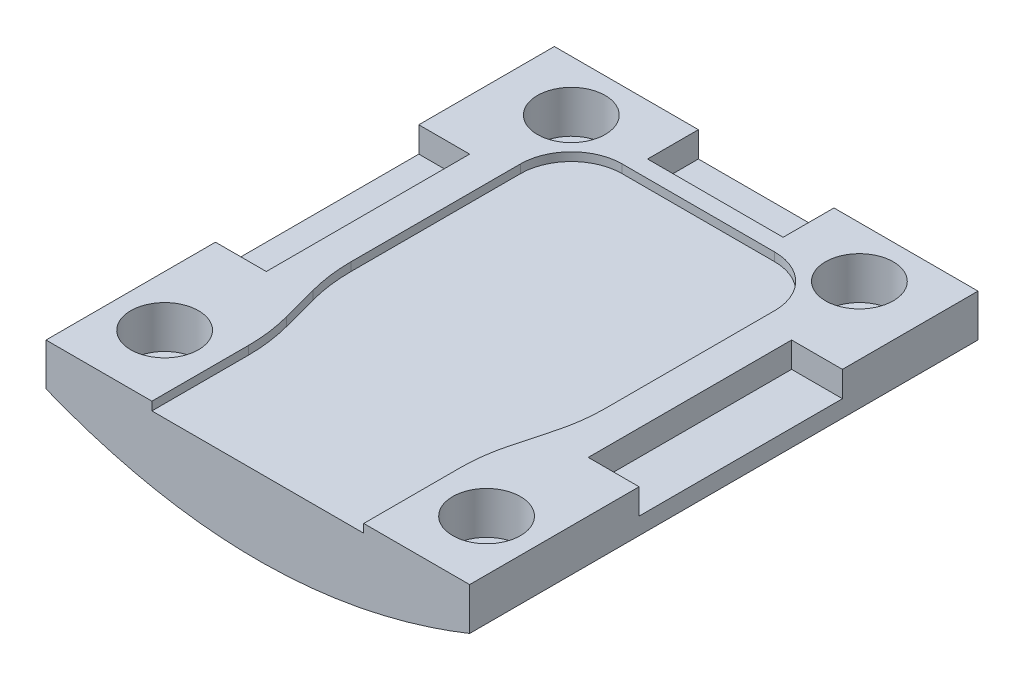
ISO-10303-21;
HEADER;
FILE_DESCRIPTION(('STEP AP214'),'2;1');
FILE_NAME('part.step','',(''),(''),'','','');
FILE_SCHEMA(('AUTOMOTIVE_DESIGN { 1 0 10303 214 1 1 1 1 }'));
ENDSEC;
DATA;
#1=APPLICATION_CONTEXT('core data for automotive mechanical design processes');
#2=APPLICATION_PROTOCOL_DEFINITION('international standard','automotive_design',2000,#1);
#3=PRODUCT_CONTEXT('',#1,'mechanical');
#4=PRODUCT('Part','Part','',(#3));
#5=PRODUCT_RELATED_PRODUCT_CATEGORY('part','',(#4));
#6=PRODUCT_DEFINITION_FORMATION('','',#4);
#7=PRODUCT_DEFINITION_CONTEXT('part definition',#1,'design');
#8=PRODUCT_DEFINITION('design','',#6,#7);
#9=PRODUCT_DEFINITION_SHAPE('','',#8);
#10=(LENGTH_UNIT() NAMED_UNIT(*) SI_UNIT(.MILLI.,.METRE.));
#11=(NAMED_UNIT(*) PLANE_ANGLE_UNIT() SI_UNIT($,.RADIAN.));
#12=(NAMED_UNIT(*) SI_UNIT($,.STERADIAN.) SOLID_ANGLE_UNIT());
#13=UNCERTAINTY_MEASURE_WITH_UNIT(LENGTH_MEASURE(1.E-05),#10,'distance_accuracy_value','');
#14=(GEOMETRIC_REPRESENTATION_CONTEXT(3) GLOBAL_UNCERTAINTY_ASSIGNED_CONTEXT((#13)) GLOBAL_UNIT_ASSIGNED_CONTEXT((#10,
#11,#12)) REPRESENTATION_CONTEXT('',''));
#15=CARTESIAN_POINT('',(0.,0.,0.));
#16=DIRECTION('',(0.,0.,1.));
#17=DIRECTION('',(1.,0.,0.));
#18=AXIS2_PLACEMENT_3D('',#15,#16,#17);
#19=CARTESIAN_POINT('',(0.,2.5,0.));
#20=DIRECTION('',(0.,0.,-1.));
#21=DIRECTION('',(-1.,0.,0.));
#22=AXIS2_PLACEMENT_3D('',#19,#20,#21);
#23=PLANE('',#22);
#24=DIRECTION('',(0.,1.,0.));
#25=VECTOR('',#24,1.);
#26=CARTESIAN_POINT('',(18.75,2.,0.));
#27=LINE('',#26,#25);
#28=CARTESIAN_POINT('',(18.75,2.,0.));
#29=VERTEX_POINT('',#28);
#30=CARTESIAN_POINT('',(18.75,2.5,0.));
#31=VERTEX_POINT('',#30);
#32=EDGE_CURVE('E463',#29,#31,#27,.T.);
#33=ORIENTED_EDGE('',*,*,#32,.F.);
#34=DIRECTION('',(1.,0.,0.));
#35=VECTOR('',#34,1.);
#36=CARTESIAN_POINT('',(6.25,2.,0.));
#37=LINE('',#36,#35);
#38=CARTESIAN_POINT('',(6.25,2.,0.));
#39=VERTEX_POINT('',#38);
#40=EDGE_CURVE('E466',#39,#29,#37,.T.);
#41=ORIENTED_EDGE('',*,*,#40,.F.);
#42=DIRECTION('',(0.,1.,0.));
#43=VECTOR('',#42,1.);
#44=CARTESIAN_POINT('',(6.25,2.,0.));
#45=LINE('',#44,#43);
#46=CARTESIAN_POINT('',(6.25,2.5,0.));
#47=VERTEX_POINT('',#46);
#48=EDGE_CURVE('E473',#39,#47,#45,.T.);
#49=ORIENTED_EDGE('',*,*,#48,.T.);
#50=DIRECTION('',(1.,0.,0.));
#51=VECTOR('',#50,1.);
#52=CARTESIAN_POINT('',(0.,2.5,0.));
#53=LINE('',#52,#51);
#54=CARTESIAN_POINT('',(0.,2.5,0.));
#55=VERTEX_POINT('',#54);
#56=EDGE_CURVE('E510',#55,#47,#53,.T.);
#57=ORIENTED_EDGE('',*,*,#56,.F.);
#58=DIRECTION('',(0.,-1.,0.));
#59=VECTOR('',#58,1.);
#60=CARTESIAN_POINT('',(0.,2.5,0.));
#61=LINE('',#60,#59);
#62=CARTESIAN_POINT('',(0.,0.,0.));
#63=VERTEX_POINT('',#62);
#64=EDGE_CURVE('E11',#55,#63,#61,.T.);
#65=ORIENTED_EDGE('',*,*,#64,.T.);
#66=CARTESIAN_POINT('',(0.,0.,0.));
#67=CARTESIAN_POINT('',(12.5,-5.,0.));
#68=CARTESIAN_POINT('',(25.,0.,0.));
#69=B_SPLINE_CURVE_WITH_KNOTS('',2,(#66,#67,#68),.UNSPECIFIED.,.F.,.F.,(3,3),(0.,1.),.UNSPECIFIED.);
#70=CARTESIAN_POINT('',(25.,0.,0.));
#71=VERTEX_POINT('',#70);
#72=EDGE_CURVE('E358',#63,#71,#69,.T.);
#73=ORIENTED_EDGE('',*,*,#72,.T.);
#74=DIRECTION('',(0.,-1.,0.));
#75=VECTOR('',#74,1.);
#76=CARTESIAN_POINT('',(25.,2.5,0.));
#77=LINE('',#76,#75);
#78=CARTESIAN_POINT('',(25.,2.5,0.));
#79=VERTEX_POINT('',#78);
#80=EDGE_CURVE('E48',#79,#71,#77,.T.);
#81=ORIENTED_EDGE('',*,*,#80,.F.);
#82=EDGE_CURVE('E468',#31,#79,#53,.T.);
#83=ORIENTED_EDGE('',*,*,#82,.F.);
#84=EDGE_LOOP('',(#33,#41,#49,#57,#65,#73,#81,#83));
#85=FACE_BOUND('',#84,.T.);
#86=ADVANCED_FACE('F39',(#85),#23,.F.);
#87=CARTESIAN_POINT('',(0.,2.5,0.));
#88=DIRECTION('',(0.,-1.,0.));
#89=DIRECTION('',(0.,0.,-1.));
#90=AXIS2_PLACEMENT_3D('',#87,#88,#89);
#91=PLANE('',#90);
#92=CARTESIAN_POINT('',(22.,2.5,-4.));
#93=DIRECTION('',(0.,1.,0.));
#94=DIRECTION('',(0.,0.,1.));
#95=AXIS2_PLACEMENT_3D('',#92,#93,#94);
#96=CIRCLE('',#95,2.);
#97=CARTESIAN_POINT('',(22.,2.5,-2.));
#98=VERTEX_POINT('',#97);
#99=EDGE_CURVE('E676',#98,#98,#96,.T.);
#100=ORIENTED_EDGE('',*,*,#99,.F.);
#101=EDGE_LOOP('',(#100));
#102=FACE_BOUND('',#101,.T.);
#103=CARTESIAN_POINT('',(3.,2.5,-4.));
#104=DIRECTION('',(0.,1.,0.));
#105=DIRECTION('',(0.,0.,1.));
#106=AXIS2_PLACEMENT_3D('',#103,#104,#105);
#107=CIRCLE('',#106,2.);
#108=CARTESIAN_POINT('',(3.,2.5,-2.));
#109=VERTEX_POINT('',#108);
#110=EDGE_CURVE('E680',#109,#109,#107,.T.);
#111=ORIENTED_EDGE('',*,*,#110,.F.);
#112=EDGE_LOOP('',(#111));
#113=FACE_BOUND('',#112,.T.);
#114=CARTESIAN_POINT('',(3.99999999999999,2.5,-27.));
#115=DIRECTION('',(0.,1.,0.));
#116=DIRECTION('',(0.,0.,1.));
#117=AXIS2_PLACEMENT_3D('',#114,#115,#116);
#118=CIRCLE('',#117,2.);
#119=CARTESIAN_POINT('',(3.99999999999999,2.5,-25.));
#120=VERTEX_POINT('',#119);
#121=EDGE_CURVE('E675',#120,#120,#118,.T.);
#122=ORIENTED_EDGE('',*,*,#121,.F.);
#123=EDGE_LOOP('',(#122));
#124=FACE_BOUND('',#123,.T.);
#125=CARTESIAN_POINT('',(21.,2.5,-27.));
#126=DIRECTION('',(0.,1.,0.));
#127=DIRECTION('',(0.,0.,1.));
#128=AXIS2_PLACEMENT_3D('',#125,#126,#127);
#129=CIRCLE('',#128,2.);
#130=CARTESIAN_POINT('',(21.,2.5,-25.));
#131=VERTEX_POINT('',#130);
#132=EDGE_CURVE('E625',#131,#131,#129,.T.);
#133=ORIENTED_EDGE('',*,*,#132,.F.);
#134=EDGE_LOOP('',(#133));
#135=FACE_BOUND('',#134,.T.);
#136=DIRECTION('',(-1.,0.,0.));
#137=VECTOR('',#136,1.);
#138=CARTESIAN_POINT('',(0.,2.5,-30.));
#139=LINE('',#138,#137);
#140=CARTESIAN_POINT('',(25.,2.5,-30.));
#141=VERTEX_POINT('',#140);
#142=CARTESIAN_POINT('',(16.5,2.5,-30.));
#143=VERTEX_POINT('',#142);
#144=EDGE_CURVE('E519',#141,#143,#139,.T.);
#145=ORIENTED_EDGE('',*,*,#144,.T.);
#146=DIRECTION('',(0.,0.,-1.));
#147=VECTOR('',#146,1.);
#148=CARTESIAN_POINT('',(16.5,2.5,-30.));
#149=LINE('',#148,#147);
#150=CARTESIAN_POINT('',(16.5,2.5,-27.));
#151=VERTEX_POINT('',#150);
#152=EDGE_CURVE('E307',#151,#143,#149,.T.);
#153=ORIENTED_EDGE('',*,*,#152,.F.);
#154=DIRECTION('',(1.,0.,0.));
#155=VECTOR('',#154,1.);
#156=CARTESIAN_POINT('',(16.5,2.5,-27.));
#157=LINE('',#156,#155);
#158=CARTESIAN_POINT('',(8.49999999999999,2.5,-27.));
#159=VERTEX_POINT('',#158);
#160=EDGE_CURVE('E1034',#159,#151,#157,.T.);
#161=ORIENTED_EDGE('',*,*,#160,.F.);
#162=DIRECTION('',(0.,0.,1.));
#163=VECTOR('',#162,1.);
#164=CARTESIAN_POINT('',(8.49999999999999,2.5,-30.));
#165=LINE('',#164,#163);
#166=CARTESIAN_POINT('',(8.49999999999999,2.5,-30.));
#167=VERTEX_POINT('',#166);
#168=EDGE_CURVE('E557',#167,#159,#165,.T.);
#169=ORIENTED_EDGE('',*,*,#168,.F.);
#170=CARTESIAN_POINT('',(0.,2.5,-30.));
#171=VERTEX_POINT('',#170);
#172=EDGE_CURVE('E267',#167,#171,#139,.T.);
#173=ORIENTED_EDGE('',*,*,#172,.T.);
#174=DIRECTION('',(0.,0.,1.));
#175=VECTOR('',#174,1.);
#176=CARTESIAN_POINT('',(0.,2.5,0.));
#177=LINE('',#176,#175);
#178=CARTESIAN_POINT('',(0.,2.5,-22.));
#179=VERTEX_POINT('',#178);
#180=EDGE_CURVE('E505',#171,#179,#177,.T.);
#181=ORIENTED_EDGE('',*,*,#180,.T.);
#182=DIRECTION('',(-1.,0.,0.));
#183=VECTOR('',#182,1.);
#184=CARTESIAN_POINT('',(0.,2.5,-22.));
#185=LINE('',#184,#183);
#186=CARTESIAN_POINT('',(2.99999999999999,2.5,-22.));
#187=VERTEX_POINT('',#186);
#188=EDGE_CURVE('E320',#187,#179,#185,.T.);
#189=ORIENTED_EDGE('',*,*,#188,.F.);
#190=DIRECTION('',(0.,0.,-1.));
#191=VECTOR('',#190,1.);
#192=CARTESIAN_POINT('',(2.99999999999999,2.5,-10.));
#193=LINE('',#192,#191);
#194=CARTESIAN_POINT('',(2.99999999999999,2.5,-10.));
#195=VERTEX_POINT('',#194);
#196=EDGE_CURVE('E334',#195,#187,#193,.T.);
#197=ORIENTED_EDGE('',*,*,#196,.F.);
#198=DIRECTION('',(1.,0.,0.));
#199=VECTOR('',#198,1.);
#200=CARTESIAN_POINT('',(0.,2.5,-10.));
#201=LINE('',#200,#199);
#202=CARTESIAN_POINT('',(0.,2.5,-10.));
#203=VERTEX_POINT('',#202);
#204=EDGE_CURVE('E330',#203,#195,#201,.T.);
#205=ORIENTED_EDGE('',*,*,#204,.F.);
#206=EDGE_CURVE('E509',#203,#55,#177,.T.);
#207=ORIENTED_EDGE('',*,*,#206,.T.);
#208=ORIENTED_EDGE('',*,*,#56,.T.);
#209=DIRECTION('',(0.,0.,1.));
#210=VECTOR('',#209,1.);
#211=CARTESIAN_POINT('',(6.25,2.5,-5.69032625050105));
#212=LINE('',#211,#210);
#213=CARTESIAN_POINT('',(6.25,2.5,-5.69032625050105));
#214=VERTEX_POINT('',#213);
#215=EDGE_CURVE('E595',#214,#47,#212,.T.);
#216=ORIENTED_EDGE('',*,*,#215,.F.);
#217=CARTESIAN_POINT('',(-3.75000000000001,2.5,-5.69032625050105));
#218=DIRECTION('',(0.,-1.,0.));
#219=DIRECTION('',(0.,0.,-1.));
#220=AXIS2_PLACEMENT_3D('',#217,#218,#219);
#221=CIRCLE('',#220,10.);
#222=CARTESIAN_POINT('',(5.91273584170009,2.5,-8.26550314802173));
#223=VERTEX_POINT('',#222);
#224=EDGE_CURVE('E598',#223,#214,#221,.T.);
#225=ORIENTED_EDGE('',*,*,#224,.F.);
#226=DIRECTION('',(0.257517689752066,0.,0.966273584170011));
#227=VECTOR('',#226,1.);
#228=CARTESIAN_POINT('',(5.3372641582999,2.5,-10.4248231024793));
#229=LINE('',#228,#227);
#230=CARTESIAN_POINT('',(5.3372641582999,2.5,-10.4248231024793));
#231=VERTEX_POINT('',#230);
#232=EDGE_CURVE('E602',#231,#223,#229,.T.);
#233=ORIENTED_EDGE('',*,*,#232,.F.);
#234=CARTESIAN_POINT('',(15.,2.5,-13.));
#235=DIRECTION('',(0.,-1.,0.));
#236=DIRECTION('',(0.,0.,-1.));
#237=AXIS2_PLACEMENT_3D('',#234,#235,#236);
#238=CIRCLE('',#237,10.);
#239=CARTESIAN_POINT('',(5.,2.5,-13.));
#240=VERTEX_POINT('',#239);
#241=EDGE_CURVE('E606',#231,#240,#238,.T.);
#242=ORIENTED_EDGE('',*,*,#241,.T.);
#243=DIRECTION('',(0.,0.,1.));
#244=VECTOR('',#243,1.);
#245=CARTESIAN_POINT('',(4.99999999999999,2.5,-23.));
#246=LINE('',#245,#244);
#247=CARTESIAN_POINT('',(4.99999999999999,2.5,-23.));
#248=VERTEX_POINT('',#247);
#249=EDGE_CURVE('E610',#248,#240,#246,.T.);
#250=ORIENTED_EDGE('',*,*,#249,.F.);
#251=CARTESIAN_POINT('',(7.99999999999999,2.5,-23.));
#252=DIRECTION('',(0.,1.,0.));
#253=DIRECTION('',(0.,0.,1.));
#254=AXIS2_PLACEMENT_3D('',#251,#252,#253);
#255=CIRCLE('',#254,3.);
#256=CARTESIAN_POINT('',(7.99999999999999,2.5,-26.));
#257=VERTEX_POINT('',#256);
#258=EDGE_CURVE('E614',#257,#248,#255,.T.);
#259=ORIENTED_EDGE('',*,*,#258,.F.);
#260=DIRECTION('',(1.,0.,0.));
#261=VECTOR('',#260,1.);
#262=CARTESIAN_POINT('',(7.99999999999999,2.5,-26.));
#263=LINE('',#262,#261);
#264=CARTESIAN_POINT('',(17.,2.5,-26.));
#265=VERTEX_POINT('',#264);
#266=EDGE_CURVE('E618',#257,#265,#263,.T.);
#267=ORIENTED_EDGE('',*,*,#266,.T.);
#268=CARTESIAN_POINT('',(17.,2.5,-23.));
#269=DIRECTION('',(0.,1.,0.));
#270=DIRECTION('',(0.,0.,1.));
#271=AXIS2_PLACEMENT_3D('',#268,#269,#270);
#272=CIRCLE('',#271,3.);
#273=CARTESIAN_POINT('',(20.,2.5,-23.));
#274=VERTEX_POINT('',#273);
#275=EDGE_CURVE('E622',#274,#265,#272,.T.);
#276=ORIENTED_EDGE('',*,*,#275,.F.);
#277=DIRECTION('',(0.,0.,1.));
#278=VECTOR('',#277,1.);
#279=CARTESIAN_POINT('',(20.,2.5,-23.));
#280=LINE('',#279,#278);
#281=CARTESIAN_POINT('',(20.,2.5,-13.));
#282=VERTEX_POINT('',#281);
#283=EDGE_CURVE('E575',#274,#282,#280,.T.);
#284=ORIENTED_EDGE('',*,*,#283,.T.);
#285=CARTESIAN_POINT('',(10.,2.5,-13.));
#286=DIRECTION('',(0.,1.,0.));
#287=DIRECTION('',(0.,0.,1.));
#288=AXIS2_PLACEMENT_3D('',#285,#286,#287);
#289=CIRCLE('',#288,10.);
#290=CARTESIAN_POINT('',(19.6627358417001,2.5,-10.4248231024793));
#291=VERTEX_POINT('',#290);
#292=EDGE_CURVE('E580',#291,#282,#289,.T.);
#293=ORIENTED_EDGE('',*,*,#292,.F.);
#294=DIRECTION('',(-0.257517689752069,0.,0.96627358417001));
#295=VECTOR('',#294,1.);
#296=CARTESIAN_POINT('',(19.6627358417001,2.5,-10.4248231024793));
#297=LINE('',#296,#295);
#298=CARTESIAN_POINT('',(19.0872641582999,2.5,-8.26550314802176));
#299=VERTEX_POINT('',#298);
#300=EDGE_CURVE('E584',#291,#299,#297,.T.);
#301=ORIENTED_EDGE('',*,*,#300,.T.);
#302=CARTESIAN_POINT('',(28.75,2.5,-5.69032625050105));
#303=DIRECTION('',(0.,1.,0.));
#304=DIRECTION('',(0.,0.,1.));
#305=AXIS2_PLACEMENT_3D('',#302,#303,#304);
#306=CIRCLE('',#305,10.);
#307=CARTESIAN_POINT('',(18.75,2.5,-5.69032625050106));
#308=VERTEX_POINT('',#307);
#309=EDGE_CURVE('E588',#299,#308,#306,.T.);
#310=ORIENTED_EDGE('',*,*,#309,.T.);
#311=DIRECTION('',(0.,0.,1.));
#312=VECTOR('',#311,1.);
#313=CARTESIAN_POINT('',(18.75,2.5,-5.69032625050105));
#314=LINE('',#313,#312);
#315=EDGE_CURVE('E592',#308,#31,#314,.T.);
#316=ORIENTED_EDGE('',*,*,#315,.T.);
#317=ORIENTED_EDGE('',*,*,#82,.T.);
#318=DIRECTION('',(0.,0.,-1.));
#319=VECTOR('',#318,1.);
#320=CARTESIAN_POINT('',(25.,2.5,0.));
#321=LINE('',#320,#319);
#322=CARTESIAN_POINT('',(25.,2.5,-10.));
#323=VERTEX_POINT('',#322);
#324=EDGE_CURVE('E515',#79,#323,#321,.T.);
#325=ORIENTED_EDGE('',*,*,#324,.T.);
#326=DIRECTION('',(1.,0.,0.));
#327=VECTOR('',#326,1.);
#328=CARTESIAN_POINT('',(25.,2.5,-10.));
#329=LINE('',#328,#327);
#330=CARTESIAN_POINT('',(22.,2.5,-10.));
#331=VERTEX_POINT('',#330);
#332=EDGE_CURVE('E282',#331,#323,#329,.T.);
#333=ORIENTED_EDGE('',*,*,#332,.F.);
#334=DIRECTION('',(0.,0.,1.));
#335=VECTOR('',#334,1.);
#336=CARTESIAN_POINT('',(22.,2.5,-10.));
#337=LINE('',#336,#335);
#338=CARTESIAN_POINT('',(22.,2.5,-22.));
#339=VERTEX_POINT('',#338);
#340=EDGE_CURVE('E296',#339,#331,#337,.T.);
#341=ORIENTED_EDGE('',*,*,#340,.F.);
#342=DIRECTION('',(-1.,0.,0.));
#343=VECTOR('',#342,1.);
#344=CARTESIAN_POINT('',(25.,2.5,-22.));
#345=LINE('',#344,#343);
#346=CARTESIAN_POINT('',(25.,2.5,-22.));
#347=VERTEX_POINT('',#346);
#348=EDGE_CURVE('E292',#347,#339,#345,.T.);
#349=ORIENTED_EDGE('',*,*,#348,.F.);
#350=EDGE_CURVE('E514',#347,#141,#321,.T.);
#351=ORIENTED_EDGE('',*,*,#350,.T.);
#352=EDGE_LOOP('',(#145,#153,#161,#169,#173,#181,#189,#197,#205,#207,#208,#216,#225,#233,#242,
#250,#259,#267,#276,#284,#293,#301,#310,#316,#317,#325,#333,#341,#349,#351));
#353=FACE_BOUND('',#352,.T.);
#354=ADVANCED_FACE('F447',(#102,#113,#124,#135,#353),#91,.F.);
#355=CARTESIAN_POINT('',(0.,2.5,0.));
#356=DIRECTION('',(1.,0.,0.));
#357=DIRECTION('',(0.,0.,-1.));
#358=AXIS2_PLACEMENT_3D('',#355,#356,#357);
#359=PLANE('',#358);
#360=DIRECTION('',(0.,0.,1.));
#361=VECTOR('',#360,1.);
#362=CARTESIAN_POINT('',(0.,1.,-10.));
#363=LINE('',#362,#361);
#364=CARTESIAN_POINT('',(0.,1.,-22.));
#365=VERTEX_POINT('',#364);
#366=CARTESIAN_POINT('',(0.,1.,-10.));
#367=VERTEX_POINT('',#366);
#368=EDGE_CURVE('E316',#365,#367,#363,.T.);
#369=ORIENTED_EDGE('',*,*,#368,.F.);
#370=DIRECTION('',(0.,1.,0.));
#371=VECTOR('',#370,1.);
#372=CARTESIAN_POINT('',(0.,1.,-22.));
#373=LINE('',#372,#371);
#374=EDGE_CURVE('E297',#365,#179,#373,.T.);
#375=ORIENTED_EDGE('',*,*,#374,.T.);
#376=ORIENTED_EDGE('',*,*,#180,.F.);
#377=DIRECTION('',(0.,-1.,0.));
#378=VECTOR('',#377,1.);
#379=CARTESIAN_POINT('',(0.,2.5,-30.));
#380=LINE('',#379,#378);
#381=CARTESIAN_POINT('',(0.,0.,-30.));
#382=VERTEX_POINT('',#381);
#383=EDGE_CURVE('E523',#171,#382,#380,.T.);
#384=ORIENTED_EDGE('',*,*,#383,.T.);
#385=DIRECTION('',(0.,0.,1.));
#386=VECTOR('',#385,1.);
#387=CARTESIAN_POINT('',(0.,0.,0.));
#388=LINE('',#387,#386);
#389=EDGE_CURVE('E524',#382,#63,#388,.T.);
#390=ORIENTED_EDGE('',*,*,#389,.T.);
#391=ORIENTED_EDGE('',*,*,#64,.F.);
#392=ORIENTED_EDGE('',*,*,#206,.F.);
#393=DIRECTION('',(0.,1.,0.));
#394=VECTOR('',#393,1.);
#395=CARTESIAN_POINT('',(0.,1.,-10.));
#396=LINE('',#395,#394);
#397=EDGE_CURVE('E329',#367,#203,#396,.T.);
#398=ORIENTED_EDGE('',*,*,#397,.F.);
#399=EDGE_LOOP('',(#369,#375,#376,#384,#390,#391,#392,#398));
#400=FACE_BOUND('',#399,.T.);
#401=ADVANCED_FACE('F41',(#400),#359,.F.);
#402=CARTESIAN_POINT('',(25.,2.5,0.));
#403=DIRECTION('',(-1.,0.,0.));
#404=DIRECTION('',(0.,0.,1.));
#405=AXIS2_PLACEMENT_3D('',#402,#403,#404);
#406=PLANE('',#405);
#407=DIRECTION('',(0.,0.,-1.));
#408=VECTOR('',#407,1.);
#409=CARTESIAN_POINT('',(25.,1.,-10.));
#410=LINE('',#409,#408);
#411=CARTESIAN_POINT('',(25.,1.,-10.));
#412=VERTEX_POINT('',#411);
#413=CARTESIAN_POINT('',(25.,1.,-22.));
#414=VERTEX_POINT('',#413);
#415=EDGE_CURVE('E278',#412,#414,#410,.T.);
#416=ORIENTED_EDGE('',*,*,#415,.F.);
#417=DIRECTION('',(0.,1.,0.));
#418=VECTOR('',#417,1.);
#419=CARTESIAN_POINT('',(25.,1.,-10.));
#420=LINE('',#419,#418);
#421=EDGE_CURVE('E303',#412,#323,#420,.T.);
#422=ORIENTED_EDGE('',*,*,#421,.T.);
#423=ORIENTED_EDGE('',*,*,#324,.F.);
#424=ORIENTED_EDGE('',*,*,#80,.T.);
#425=DIRECTION('',(0.,0.,-1.));
#426=VECTOR('',#425,1.);
#427=CARTESIAN_POINT('',(25.,0.,0.));
#428=LINE('',#427,#426);
#429=CARTESIAN_POINT('',(25.,0.,-30.));
#430=VERTEX_POINT('',#429);
#431=EDGE_CURVE('E528',#71,#430,#428,.T.);
#432=ORIENTED_EDGE('',*,*,#431,.T.);
#433=DIRECTION('',(0.,-1.,0.));
#434=VECTOR('',#433,1.);
#435=CARTESIAN_POINT('',(25.,2.5,-30.));
#436=LINE('',#435,#434);
#437=EDGE_CURVE('E536',#141,#430,#436,.T.);
#438=ORIENTED_EDGE('',*,*,#437,.F.);
#439=ORIENTED_EDGE('',*,*,#350,.F.);
#440=DIRECTION('',(0.,1.,0.));
#441=VECTOR('',#440,1.);
#442=CARTESIAN_POINT('',(25.,1.,-22.));
#443=LINE('',#442,#441);
#444=EDGE_CURVE('E291',#414,#347,#443,.T.);
#445=ORIENTED_EDGE('',*,*,#444,.F.);
#446=EDGE_LOOP('',(#416,#422,#423,#424,#432,#438,#439,#445));
#447=FACE_BOUND('',#446,.T.);
#448=ADVANCED_FACE('F453',(#447),#406,.F.);
#449=CARTESIAN_POINT('',(0.,2.5,-30.));
#450=DIRECTION('',(0.,0.,1.));
#451=DIRECTION('',(1.,0.,0.));
#452=AXIS2_PLACEMENT_3D('',#449,#450,#451);
#453=PLANE('',#452);
#454=DIRECTION('',(-1.,0.,0.));
#455=VECTOR('',#454,1.);
#456=CARTESIAN_POINT('',(16.5,1.,-30.));
#457=LINE('',#456,#455);
#458=CARTESIAN_POINT('',(16.5,1.,-30.));
#459=VERTEX_POINT('',#458);
#460=CARTESIAN_POINT('',(8.49999999999999,1.,-30.));
#461=VERTEX_POINT('',#460);
#462=EDGE_CURVE('E253',#459,#461,#457,.T.);
#463=ORIENTED_EDGE('',*,*,#462,.F.);
#464=DIRECTION('',(0.,1.,0.));
#465=VECTOR('',#464,1.);
#466=CARTESIAN_POINT('',(16.5,1.,-30.));
#467=LINE('',#466,#465);
#468=EDGE_CURVE('E269',#459,#143,#467,.T.);
#469=ORIENTED_EDGE('',*,*,#468,.T.);
#470=ORIENTED_EDGE('',*,*,#144,.F.);
#471=ORIENTED_EDGE('',*,*,#437,.T.);
#472=CARTESIAN_POINT('',(0.,0.,-30.));
#473=CARTESIAN_POINT('',(12.5,-5.,-30.));
#474=CARTESIAN_POINT('',(25.,0.,-30.));
#475=B_SPLINE_CURVE_WITH_KNOTS('',2,(#472,#473,#474),.UNSPECIFIED.,.F.,.F.,(3,3),(0.,1.),.UNSPECIFIED.);
#476=EDGE_CURVE('E351',#382,#430,#475,.T.);
#477=ORIENTED_EDGE('',*,*,#476,.F.);
#478=ORIENTED_EDGE('',*,*,#383,.F.);
#479=ORIENTED_EDGE('',*,*,#172,.F.);
#480=DIRECTION('',(0.,1.,0.));
#481=VECTOR('',#480,1.);
#482=CARTESIAN_POINT('',(8.49999999999999,1.,-30.));
#483=LINE('',#482,#481);
#484=EDGE_CURVE('E245',#461,#167,#483,.T.);
#485=ORIENTED_EDGE('',*,*,#484,.F.);
#486=EDGE_LOOP('',(#463,#469,#470,#471,#477,#478,#479,#485));
#487=FACE_BOUND('',#486,.T.);
#488=ADVANCED_FACE('F265',(#487),#453,.F.);
#489=CARTESIAN_POINT('',(17.,2.,-23.));
#490=DIRECTION('',(0.,1.,0.));
#491=DIRECTION('',(0.,0.,1.));
#492=AXIS2_PLACEMENT_3D('',#489,#490,#491);
#493=CYLINDRICAL_SURFACE('',#492,3.);
#494=ORIENTED_EDGE('',*,*,#275,.T.);
#495=DIRECTION('',(0.,1.,0.));
#496=VECTOR('',#495,1.);
#497=CARTESIAN_POINT('',(17.,2.,-26.));
#498=LINE('',#497,#496);
#499=CARTESIAN_POINT('',(17.,2.,-26.));
#500=VERTEX_POINT('',#499);
#501=EDGE_CURVE('E500',#500,#265,#498,.T.);
#502=ORIENTED_EDGE('',*,*,#501,.F.);
#503=CARTESIAN_POINT('',(17.,2.,-23.));
#504=DIRECTION('',(0.,1.,0.));
#505=DIRECTION('',(0.,0.,1.));
#506=AXIS2_PLACEMENT_3D('',#503,#504,#505);
#507=CIRCLE('',#506,3.);
#508=CARTESIAN_POINT('',(20.,2.,-23.));
#509=VERTEX_POINT('',#508);
#510=EDGE_CURVE('E579',#509,#500,#507,.T.);
#511=ORIENTED_EDGE('',*,*,#510,.F.);
#512=DIRECTION('',(0.,1.,0.));
#513=VECTOR('',#512,1.);
#514=CARTESIAN_POINT('',(20.,2.,-23.));
#515=LINE('',#514,#513);
#516=EDGE_CURVE('E529',#509,#274,#515,.T.);
#517=ORIENTED_EDGE('',*,*,#516,.T.);
#518=EDGE_LOOP('',(#494,#502,#511,#517));
#519=FACE_BOUND('',#518,.T.);
#520=ADVANCED_FACE('F400',(#519),#493,.F.);
#521=CARTESIAN_POINT('',(20.,2.,-23.));
#522=DIRECTION('',(-1.,0.,0.));
#523=DIRECTION('',(0.,0.,1.));
#524=AXIS2_PLACEMENT_3D('',#521,#522,#523);
#525=PLANE('',#524);
#526=ORIENTED_EDGE('',*,*,#283,.F.);
#527=ORIENTED_EDGE('',*,*,#516,.F.);
#528=DIRECTION('',(0.,0.,1.));
#529=VECTOR('',#528,1.);
#530=CARTESIAN_POINT('',(20.,2.,-23.));
#531=LINE('',#530,#529);
#532=CARTESIAN_POINT('',(20.,2.,-13.));
#533=VERTEX_POINT('',#532);
#534=EDGE_CURVE('E504',#509,#533,#531,.T.);
#535=ORIENTED_EDGE('',*,*,#534,.T.);
#536=DIRECTION('',(0.,1.,0.));
#537=VECTOR('',#536,1.);
#538=CARTESIAN_POINT('',(20.,2.,-13.));
#539=LINE('',#538,#537);
#540=EDGE_CURVE('E564',#533,#282,#539,.T.);
#541=ORIENTED_EDGE('',*,*,#540,.T.);
#542=EDGE_LOOP('',(#526,#527,#535,#541));
#543=FACE_BOUND('',#542,.T.);
#544=ADVANCED_FACE('F396',(#543),#525,.T.);
#545=CARTESIAN_POINT('',(10.,2.,-13.));
#546=DIRECTION('',(0.,1.,0.));
#547=DIRECTION('',(0.,0.,1.));
#548=AXIS2_PLACEMENT_3D('',#545,#546,#547);
#549=CYLINDRICAL_SURFACE('',#548,10.);
#550=ORIENTED_EDGE('',*,*,#292,.T.);
#551=ORIENTED_EDGE('',*,*,#540,.F.);
#552=CARTESIAN_POINT('',(10.,2.,-13.));
#553=DIRECTION('',(0.,1.,0.));
#554=DIRECTION('',(0.,0.,1.));
#555=AXIS2_PLACEMENT_3D('',#552,#553,#554);
#556=CIRCLE('',#555,10.);
#557=CARTESIAN_POINT('',(19.6627358417001,2.,-10.4248231024793));
#558=VERTEX_POINT('',#557);
#559=EDGE_CURVE('E628',#558,#533,#556,.T.);
#560=ORIENTED_EDGE('',*,*,#559,.F.);
#561=DIRECTION('',(0.,1.,0.));
#562=VECTOR('',#561,1.);
#563=CARTESIAN_POINT('',(19.6627358417001,2.,-10.4248231024793));
#564=LINE('',#563,#562);
#565=EDGE_CURVE('E567',#558,#291,#564,.T.);
#566=ORIENTED_EDGE('',*,*,#565,.T.);
#567=EDGE_LOOP('',(#550,#551,#560,#566));
#568=FACE_BOUND('',#567,.T.);
#569=ADVANCED_FACE('F399',(#568),#549,.F.);
#570=CARTESIAN_POINT('',(19.6627358417001,2.,-10.4248231024793));
#571=DIRECTION('',(-0.96627358417001,0.,-0.257517689752069));
#572=DIRECTION('',(-0.257517689752069,0.,0.96627358417001));
#573=AXIS2_PLACEMENT_3D('',#570,#571,#572);
#574=PLANE('',#573);
#575=ORIENTED_EDGE('',*,*,#300,.F.);
#576=ORIENTED_EDGE('',*,*,#565,.F.);
#577=DIRECTION('',(-0.257517689752069,0.,0.96627358417001));
#578=VECTOR('',#577,1.);
#579=CARTESIAN_POINT('',(19.6627358417001,2.,-10.4248231024793));
#580=LINE('',#579,#578);
#581=CARTESIAN_POINT('',(19.0872641582999,2.,-8.26550314802176));
#582=VERTEX_POINT('',#581);
#583=EDGE_CURVE('E632',#558,#582,#580,.T.);
#584=ORIENTED_EDGE('',*,*,#583,.T.);
#585=DIRECTION('',(0.,1.,0.));
#586=VECTOR('',#585,1.);
#587=CARTESIAN_POINT('',(19.0872641582999,2.,-8.26550314802176));
#588=LINE('',#587,#586);
#589=EDGE_CURVE('E477',#582,#299,#588,.T.);
#590=ORIENTED_EDGE('',*,*,#589,.T.);
#591=EDGE_LOOP('',(#575,#576,#584,#590));
#592=FACE_BOUND('',#591,.T.);
#593=ADVANCED_FACE('F404',(#592),#574,.T.);
#594=CARTESIAN_POINT('',(28.75,2.,-5.69032625050105));
#595=DIRECTION('',(0.,1.,0.));
#596=DIRECTION('',(0.,0.,1.));
#597=AXIS2_PLACEMENT_3D('',#594,#595,#596);
#598=CYLINDRICAL_SURFACE('',#597,10.);
#599=ORIENTED_EDGE('',*,*,#309,.F.);
#600=ORIENTED_EDGE('',*,*,#589,.F.);
#601=CARTESIAN_POINT('',(28.75,2.,-5.69032625050105));
#602=DIRECTION('',(0.,1.,0.));
#603=DIRECTION('',(0.,0.,1.));
#604=AXIS2_PLACEMENT_3D('',#601,#602,#603);
#605=CIRCLE('',#604,10.);
#606=CARTESIAN_POINT('',(18.75,2.,-5.69032625050106));
#607=VERTEX_POINT('',#606);
#608=EDGE_CURVE('E635',#582,#607,#605,.T.);
#609=ORIENTED_EDGE('',*,*,#608,.T.);
#610=DIRECTION('',(0.,1.,0.));
#611=VECTOR('',#610,1.);
#612=CARTESIAN_POINT('',(18.75,2.,-5.69032625050106));
#613=LINE('',#612,#611);
#614=EDGE_CURVE('E472',#607,#308,#613,.T.);
#615=ORIENTED_EDGE('',*,*,#614,.T.);
#616=EDGE_LOOP('',(#599,#600,#609,#615));
#617=FACE_BOUND('',#616,.T.);
#618=ADVANCED_FACE('F408',(#617),#598,.T.);
#619=CARTESIAN_POINT('',(18.75,2.,-5.69032625050105));
#620=DIRECTION('',(-1.,0.,0.));
#621=DIRECTION('',(0.,0.,1.));
#622=AXIS2_PLACEMENT_3D('',#619,#620,#621);
#623=PLANE('',#622);
#624=ORIENTED_EDGE('',*,*,#315,.F.);
#625=ORIENTED_EDGE('',*,*,#614,.F.);
#626=DIRECTION('',(0.,0.,1.));
#627=VECTOR('',#626,1.);
#628=CARTESIAN_POINT('',(18.75,2.,-5.69032625050105));
#629=LINE('',#628,#627);
#630=EDGE_CURVE('E638',#607,#29,#629,.T.);
#631=ORIENTED_EDGE('',*,*,#630,.T.);
#632=ORIENTED_EDGE('',*,*,#32,.T.);
#633=EDGE_LOOP('',(#624,#625,#631,#632));
#634=FACE_BOUND('',#633,.T.);
#635=ADVANCED_FACE('F412',(#634),#623,.T.);
#636=CARTESIAN_POINT('',(6.25,2.,-5.69032625050105));
#637=DIRECTION('',(-1.,0.,0.));
#638=DIRECTION('',(0.,0.,1.));
#639=AXIS2_PLACEMENT_3D('',#636,#637,#638);
#640=PLANE('',#639);
#641=ORIENTED_EDGE('',*,*,#215,.T.);
#642=ORIENTED_EDGE('',*,*,#48,.F.);
#643=DIRECTION('',(0.,0.,1.));
#644=VECTOR('',#643,1.);
#645=CARTESIAN_POINT('',(6.25,2.,-5.69032625050105));
#646=LINE('',#645,#644);
#647=CARTESIAN_POINT('',(6.25,2.,-5.69032625050105));
#648=VERTEX_POINT('',#647);
#649=EDGE_CURVE('E643',#648,#39,#646,.T.);
#650=ORIENTED_EDGE('',*,*,#649,.F.);
#651=DIRECTION('',(0.,1.,0.));
#652=VECTOR('',#651,1.);
#653=CARTESIAN_POINT('',(6.25,2.,-5.69032625050105));
#654=LINE('',#653,#652);
#655=EDGE_CURVE('E479',#648,#214,#654,.T.);
#656=ORIENTED_EDGE('',*,*,#655,.T.);
#657=EDGE_LOOP('',(#641,#642,#650,#656));
#658=FACE_BOUND('',#657,.T.);
#659=ADVANCED_FACE('F416',(#658),#640,.F.);
#660=CARTESIAN_POINT('',(-3.75000000000001,2.,-5.69032625050105));
#661=DIRECTION('',(0.,1.,0.));
#662=DIRECTION('',(0.,0.,1.));
#663=AXIS2_PLACEMENT_3D('',#660,#661,#662);
#664=CYLINDRICAL_SURFACE('',#663,10.);
#665=ORIENTED_EDGE('',*,*,#224,.T.);
#666=ORIENTED_EDGE('',*,*,#655,.F.);
#667=CARTESIAN_POINT('',(-3.75000000000001,2.,-5.69032625050105));
#668=DIRECTION('',(0.,-1.,0.));
#669=DIRECTION('',(0.,0.,-1.));
#670=AXIS2_PLACEMENT_3D('',#667,#668,#669);
#671=CIRCLE('',#670,10.);
#672=CARTESIAN_POINT('',(5.91273584170009,2.,-8.26550314802173));
#673=VERTEX_POINT('',#672);
#674=EDGE_CURVE('E647',#673,#648,#671,.T.);
#675=ORIENTED_EDGE('',*,*,#674,.F.);
#676=DIRECTION('',(0.,1.,0.));
#677=VECTOR('',#676,1.);
#678=CARTESIAN_POINT('',(5.91273584170009,2.,-8.26550314802173));
#679=LINE('',#678,#677);
#680=EDGE_CURVE('E485',#673,#223,#679,.T.);
#681=ORIENTED_EDGE('',*,*,#680,.T.);
#682=EDGE_LOOP('',(#665,#666,#675,#681));
#683=FACE_BOUND('',#682,.T.);
#684=ADVANCED_FACE('F420',(#683),#664,.T.);
#685=CARTESIAN_POINT('',(5.3372641582999,2.,-10.4248231024793));
#686=DIRECTION('',(-0.966273584170011,0.,0.257517689752066));
#687=DIRECTION('',(0.257517689752066,0.,0.966273584170011));
#688=AXIS2_PLACEMENT_3D('',#685,#686,#687);
#689=PLANE('',#688);
#690=ORIENTED_EDGE('',*,*,#232,.T.);
#691=ORIENTED_EDGE('',*,*,#680,.F.);
#692=DIRECTION('',(0.257517689752066,0.,0.966273584170011));
#693=VECTOR('',#692,1.);
#694=CARTESIAN_POINT('',(5.3372641582999,2.,-10.4248231024793));
#695=LINE('',#694,#693);
#696=CARTESIAN_POINT('',(5.3372641582999,2.,-10.4248231024793));
#697=VERTEX_POINT('',#696);
#698=EDGE_CURVE('E651',#697,#673,#695,.T.);
#699=ORIENTED_EDGE('',*,*,#698,.F.);
#700=DIRECTION('',(0.,1.,0.));
#701=VECTOR('',#700,1.);
#702=CARTESIAN_POINT('',(5.3372641582999,2.,-10.4248231024793));
#703=LINE('',#702,#701);
#704=EDGE_CURVE('E488',#697,#231,#703,.T.);
#705=ORIENTED_EDGE('',*,*,#704,.T.);
#706=EDGE_LOOP('',(#690,#691,#699,#705));
#707=FACE_BOUND('',#706,.T.);
#708=ADVANCED_FACE('F424',(#707),#689,.F.);
#709=CARTESIAN_POINT('',(15.,2.,-13.));
#710=DIRECTION('',(0.,1.,0.));
#711=DIRECTION('',(0.,0.,1.));
#712=AXIS2_PLACEMENT_3D('',#709,#710,#711);
#713=CYLINDRICAL_SURFACE('',#712,10.);
#714=ORIENTED_EDGE('',*,*,#241,.F.);
#715=ORIENTED_EDGE('',*,*,#704,.F.);
#716=CARTESIAN_POINT('',(15.,2.,-13.));
#717=DIRECTION('',(0.,-1.,0.));
#718=DIRECTION('',(0.,0.,-1.));
#719=AXIS2_PLACEMENT_3D('',#716,#717,#718);
#720=CIRCLE('',#719,10.);
#721=CARTESIAN_POINT('',(5.,2.,-13.));
#722=VERTEX_POINT('',#721);
#723=EDGE_CURVE('E655',#697,#722,#720,.T.);
#724=ORIENTED_EDGE('',*,*,#723,.T.);
#725=DIRECTION('',(0.,1.,0.));
#726=VECTOR('',#725,1.);
#727=CARTESIAN_POINT('',(5.,2.,-13.));
#728=LINE('',#727,#726);
#729=EDGE_CURVE('E491',#722,#240,#728,.T.);
#730=ORIENTED_EDGE('',*,*,#729,.T.);
#731=EDGE_LOOP('',(#714,#715,#724,#730));
#732=FACE_BOUND('',#731,.T.);
#733=ADVANCED_FACE('F428',(#732),#713,.F.);
#734=CARTESIAN_POINT('',(4.99999999999999,2.,-23.));
#735=DIRECTION('',(-1.,0.,0.));
#736=DIRECTION('',(0.,0.,1.));
#737=AXIS2_PLACEMENT_3D('',#734,#735,#736);
#738=PLANE('',#737);
#739=ORIENTED_EDGE('',*,*,#249,.T.);
#740=ORIENTED_EDGE('',*,*,#729,.F.);
#741=DIRECTION('',(0.,0.,1.));
#742=VECTOR('',#741,1.);
#743=CARTESIAN_POINT('',(4.99999999999999,2.,-23.));
#744=LINE('',#743,#742);
#745=CARTESIAN_POINT('',(4.99999999999999,2.,-23.));
#746=VERTEX_POINT('',#745);
#747=EDGE_CURVE('E658',#746,#722,#744,.T.);
#748=ORIENTED_EDGE('',*,*,#747,.F.);
#749=DIRECTION('',(0.,1.,0.));
#750=VECTOR('',#749,1.);
#751=CARTESIAN_POINT('',(4.99999999999999,2.,-23.));
#752=LINE('',#751,#750);
#753=EDGE_CURVE('E494',#746,#248,#752,.T.);
#754=ORIENTED_EDGE('',*,*,#753,.T.);
#755=EDGE_LOOP('',(#739,#740,#748,#754));
#756=FACE_BOUND('',#755,.T.);
#757=ADVANCED_FACE('F432',(#756),#738,.F.);
#758=CARTESIAN_POINT('',(7.99999999999999,2.,-23.));
#759=DIRECTION('',(0.,1.,0.));
#760=DIRECTION('',(0.,0.,1.));
#761=AXIS2_PLACEMENT_3D('',#758,#759,#760);
#762=CYLINDRICAL_SURFACE('',#761,3.);
#763=ORIENTED_EDGE('',*,*,#258,.T.);
#764=ORIENTED_EDGE('',*,*,#753,.F.);
#765=CARTESIAN_POINT('',(7.99999999999999,2.,-23.));
#766=DIRECTION('',(0.,1.,0.));
#767=DIRECTION('',(0.,0.,1.));
#768=AXIS2_PLACEMENT_3D('',#765,#766,#767);
#769=CIRCLE('',#768,3.);
#770=CARTESIAN_POINT('',(7.99999999999999,2.,-26.));
#771=VERTEX_POINT('',#770);
#772=EDGE_CURVE('E662',#771,#746,#769,.T.);
#773=ORIENTED_EDGE('',*,*,#772,.F.);
#774=DIRECTION('',(0.,1.,0.));
#775=VECTOR('',#774,1.);
#776=CARTESIAN_POINT('',(7.99999999999999,2.,-26.));
#777=LINE('',#776,#775);
#778=EDGE_CURVE('E497',#771,#257,#777,.T.);
#779=ORIENTED_EDGE('',*,*,#778,.T.);
#780=EDGE_LOOP('',(#763,#764,#773,#779));
#781=FACE_BOUND('',#780,.T.);
#782=ADVANCED_FACE('F436',(#781),#762,.F.);
#783=CARTESIAN_POINT('',(7.99999999999999,2.,-26.));
#784=DIRECTION('',(0.,0.,1.));
#785=DIRECTION('',(1.,0.,0.));
#786=AXIS2_PLACEMENT_3D('',#783,#784,#785);
#787=PLANE('',#786);
#788=ORIENTED_EDGE('',*,*,#266,.F.);
#789=ORIENTED_EDGE('',*,*,#778,.F.);
#790=DIRECTION('',(1.,0.,0.));
#791=VECTOR('',#790,1.);
#792=CARTESIAN_POINT('',(7.99999999999999,2.,-26.));
#793=LINE('',#792,#791);
#794=EDGE_CURVE('E666',#771,#500,#793,.T.);
#795=ORIENTED_EDGE('',*,*,#794,.T.);
#796=ORIENTED_EDGE('',*,*,#501,.T.);
#797=EDGE_LOOP('',(#788,#789,#795,#796));
#798=FACE_BOUND('',#797,.T.);
#799=ADVANCED_FACE('F394',(#798),#787,.T.);
#800=CARTESIAN_POINT('',(17.,2.,-23.));
#801=DIRECTION('',(0.,1.,0.));
#802=DIRECTION('',(0.,0.,1.));
#803=AXIS2_PLACEMENT_3D('',#800,#801,#802);
#804=PLANE('',#803);
#805=ORIENTED_EDGE('',*,*,#510,.T.);
#806=ORIENTED_EDGE('',*,*,#794,.F.);
#807=ORIENTED_EDGE('',*,*,#772,.T.);
#808=ORIENTED_EDGE('',*,*,#747,.T.);
#809=ORIENTED_EDGE('',*,*,#723,.F.);
#810=ORIENTED_EDGE('',*,*,#698,.T.);
#811=ORIENTED_EDGE('',*,*,#674,.T.);
#812=ORIENTED_EDGE('',*,*,#649,.T.);
#813=ORIENTED_EDGE('',*,*,#40,.T.);
#814=ORIENTED_EDGE('',*,*,#630,.F.);
#815=ORIENTED_EDGE('',*,*,#608,.F.);
#816=ORIENTED_EDGE('',*,*,#583,.F.);
#817=ORIENTED_EDGE('',*,*,#559,.T.);
#818=ORIENTED_EDGE('',*,*,#534,.F.);
#819=EDGE_LOOP('',(#805,#806,#807,#808,#809,#810,#811,#812,#813,#814,#815,#816,#817,#818));
#820=FACE_BOUND('',#819,.T.);
#821=ADVANCED_FACE('F390',(#820),#804,.T.);
#822=CARTESIAN_POINT('',(21.,-1.,-27.));
#823=DIRECTION('',(0.,1.,0.));
#824=DIRECTION('',(0.,0.,1.));
#825=AXIS2_PLACEMENT_3D('',#822,#823,#824);
#826=CYLINDRICAL_SURFACE('',#825,2.);
#827=CARTESIAN_POINT('',(21.,0.,-27.));
#828=DIRECTION('',(0.,1.,0.));
#829=DIRECTION('',(0.,0.,1.));
#830=AXIS2_PLACEMENT_3D('',#827,#828,#829);
#831=CIRCLE('',#830,2.);
#832=CARTESIAN_POINT('',(21.,0.,-25.));
#833=VERTEX_POINT('',#832);
#834=EDGE_CURVE('E681',#833,#833,#831,.F.);
#835=ORIENTED_EDGE('',*,*,#834,.T.);
#836=EDGE_LOOP('',(#835));
#837=FACE_BOUND('',#836,.T.);
#838=ORIENTED_EDGE('',*,*,#132,.T.);
#839=EDGE_LOOP('',(#838));
#840=FACE_BOUND('',#839,.T.);
#841=ADVANCED_FACE('F378',(#837,#840),#826,.F.);
#842=CARTESIAN_POINT('',(3.99999999999999,-1.,-27.));
#843=DIRECTION('',(0.,1.,0.));
#844=DIRECTION('',(0.,0.,1.));
#845=AXIS2_PLACEMENT_3D('',#842,#843,#844);
#846=CYLINDRICAL_SURFACE('',#845,2.);
#847=CARTESIAN_POINT('',(3.99999999999999,0.,-27.));
#848=DIRECTION('',(0.,1.,0.));
#849=DIRECTION('',(0.,0.,1.));
#850=AXIS2_PLACEMENT_3D('',#847,#848,#849);
#851=CIRCLE('',#850,2.);
#852=CARTESIAN_POINT('',(3.99999999999999,0.,-25.));
#853=VERTEX_POINT('',#852);
#854=EDGE_CURVE('E691',#853,#853,#851,.F.);
#855=ORIENTED_EDGE('',*,*,#854,.T.);
#856=EDGE_LOOP('',(#855));
#857=FACE_BOUND('',#856,.T.);
#858=ORIENTED_EDGE('',*,*,#121,.T.);
#859=EDGE_LOOP('',(#858));
#860=FACE_BOUND('',#859,.T.);
#861=ADVANCED_FACE('F374',(#857,#860),#846,.F.);
#862=CARTESIAN_POINT('',(3.,-1.,-4.));
#863=DIRECTION('',(0.,1.,0.));
#864=DIRECTION('',(0.,0.,1.));
#865=AXIS2_PLACEMENT_3D('',#862,#863,#864);
#866=CYLINDRICAL_SURFACE('',#865,2.);
#867=CARTESIAN_POINT('',(3.,0.,-4.));
#868=DIRECTION('',(0.,1.,0.));
#869=DIRECTION('',(0.,0.,1.));
#870=AXIS2_PLACEMENT_3D('',#867,#868,#869);
#871=CIRCLE('',#870,2.);
#872=CARTESIAN_POINT('',(3.,0.,-2.));
#873=VERTEX_POINT('',#872);
#874=EDGE_CURVE('E695',#873,#873,#871,.F.);
#875=ORIENTED_EDGE('',*,*,#874,.T.);
#876=EDGE_LOOP('',(#875));
#877=FACE_BOUND('',#876,.T.);
#878=ORIENTED_EDGE('',*,*,#110,.T.);
#879=EDGE_LOOP('',(#878));
#880=FACE_BOUND('',#879,.T.);
#881=ADVANCED_FACE('F377',(#877,#880),#866,.F.);
#882=CARTESIAN_POINT('',(22.,-1.,-4.));
#883=DIRECTION('',(0.,1.,0.));
#884=DIRECTION('',(0.,0.,1.));
#885=AXIS2_PLACEMENT_3D('',#882,#883,#884);
#886=CYLINDRICAL_SURFACE('',#885,2.);
#887=CARTESIAN_POINT('',(22.,0.,-4.));
#888=DIRECTION('',(0.,1.,0.));
#889=DIRECTION('',(0.,0.,1.));
#890=AXIS2_PLACEMENT_3D('',#887,#888,#889);
#891=CIRCLE('',#890,2.);
#892=CARTESIAN_POINT('',(22.,0.,-2.));
#893=VERTEX_POINT('',#892);
#894=EDGE_CURVE('E357',#893,#893,#891,.F.);
#895=ORIENTED_EDGE('',*,*,#894,.T.);
#896=EDGE_LOOP('',(#895));
#897=FACE_BOUND('',#896,.T.);
#898=ORIENTED_EDGE('',*,*,#99,.T.);
#899=EDGE_LOOP('',(#898));
#900=FACE_BOUND('',#899,.T.);
#901=ADVANCED_FACE('F382',(#897,#900),#886,.F.);
#902=CARTESIAN_POINT('',(25.,0.,-30.));
#903=DIRECTION('',(0.,1.,0.));
#904=DIRECTION('',(0.,0.,1.));
#905=AXIS2_PLACEMENT_3D('',#902,#903,#904);
#906=PLANE('',#905);
#907=ORIENTED_EDGE('',*,*,#894,.F.);
#908=EDGE_LOOP('',(#907));
#909=FACE_BOUND('',#908,.T.);
#910=ADVANCED_FACE('F386',(#909),#906,.T.);
#911=ORIENTED_EDGE('',*,*,#874,.F.);
#912=EDGE_LOOP('',(#911));
#913=FACE_BOUND('',#912,.T.);
#914=ADVANCED_FACE('F704',(#913),#906,.T.);
#915=ORIENTED_EDGE('',*,*,#854,.F.);
#916=EDGE_LOOP('',(#915));
#917=FACE_BOUND('',#916,.T.);
#918=ADVANCED_FACE('F708',(#917),#906,.T.);
#919=ORIENTED_EDGE('',*,*,#834,.F.);
#920=EDGE_LOOP('',(#919));
#921=FACE_BOUND('',#920,.T.);
#922=ADVANCED_FACE('F371',(#921),#906,.T.);
#923=DIRECTION('',(0.,0.,1.));
#924=VECTOR('',#923,1.);
#925=SURFACE_OF_LINEAR_EXTRUSION('',#475,#924);
#926=ORIENTED_EDGE('',*,*,#72,.F.);
#927=ORIENTED_EDGE('',*,*,#389,.F.);
#928=ORIENTED_EDGE('',*,*,#476,.T.);
#929=ORIENTED_EDGE('',*,*,#431,.F.);
#930=EDGE_LOOP('',(#926,#927,#928,#929));
#931=FACE_BOUND('',#930,.T.);
#932=ADVANCED_FACE('F366',(#931),#925,.T.);
#933=CARTESIAN_POINT('',(16.5,1.,-30.));
#934=DIRECTION('',(1.,0.,0.));
#935=DIRECTION('',(0.,0.,-1.));
#936=AXIS2_PLACEMENT_3D('',#933,#934,#935);
#937=PLANE('',#936);
#938=ORIENTED_EDGE('',*,*,#152,.T.);
#939=ORIENTED_EDGE('',*,*,#468,.F.);
#940=DIRECTION('',(0.,0.,-1.));
#941=VECTOR('',#940,1.);
#942=CARTESIAN_POINT('',(16.5,1.,-30.));
#943=LINE('',#942,#941);
#944=CARTESIAN_POINT('',(16.5,1.,-27.));
#945=VERTEX_POINT('',#944);
#946=EDGE_CURVE('E258',#945,#459,#943,.T.);
#947=ORIENTED_EDGE('',*,*,#946,.F.);
#948=DIRECTION('',(0.,1.,0.));
#949=VECTOR('',#948,1.);
#950=CARTESIAN_POINT('',(16.5,1.,-27.));
#951=LINE('',#950,#949);
#952=EDGE_CURVE('E273',#945,#151,#951,.T.);
#953=ORIENTED_EDGE('',*,*,#952,.T.);
#954=EDGE_LOOP('',(#938,#939,#947,#953));
#955=FACE_BOUND('',#954,.T.);
#956=ADVANCED_FACE('F370',(#955),#937,.F.);
#957=CARTESIAN_POINT('',(16.5,1.,-27.));
#958=DIRECTION('',(0.,0.,1.));
#959=DIRECTION('',(1.,0.,0.));
#960=AXIS2_PLACEMENT_3D('',#957,#958,#959);
#961=PLANE('',#960);
#962=ORIENTED_EDGE('',*,*,#160,.T.);
#963=ORIENTED_EDGE('',*,*,#952,.F.);
#964=DIRECTION('',(1.,0.,0.));
#965=VECTOR('',#964,1.);
#966=CARTESIAN_POINT('',(16.5,1.,-27.));
#967=LINE('',#966,#965);
#968=CARTESIAN_POINT('',(8.49999999999999,1.,-27.));
#969=VERTEX_POINT('',#968);
#970=EDGE_CURVE('E252',#969,#945,#967,.T.);
#971=ORIENTED_EDGE('',*,*,#970,.F.);
#972=DIRECTION('',(0.,1.,0.));
#973=VECTOR('',#972,1.);
#974=CARTESIAN_POINT('',(8.49999999999999,1.,-27.));
#975=LINE('',#974,#973);
#976=EDGE_CURVE('E247',#969,#159,#975,.T.);
#977=ORIENTED_EDGE('',*,*,#976,.T.);
#978=EDGE_LOOP('',(#962,#963,#971,#977));
#979=FACE_BOUND('',#978,.T.);
#980=ADVANCED_FACE('F888',(#979),#961,.F.);
#981=CARTESIAN_POINT('',(8.49999999999999,1.,-30.));
#982=DIRECTION('',(-1.,0.,0.));
#983=DIRECTION('',(0.,0.,1.));
#984=AXIS2_PLACEMENT_3D('',#981,#982,#983);
#985=PLANE('',#984);
#986=ORIENTED_EDGE('',*,*,#168,.T.);
#987=ORIENTED_EDGE('',*,*,#976,.F.);
#988=DIRECTION('',(0.,0.,1.));
#989=VECTOR('',#988,1.);
#990=CARTESIAN_POINT('',(8.49999999999999,1.,-30.));
#991=LINE('',#990,#989);
#992=EDGE_CURVE('E240',#461,#969,#991,.T.);
#993=ORIENTED_EDGE('',*,*,#992,.F.);
#994=ORIENTED_EDGE('',*,*,#484,.T.);
#995=EDGE_LOOP('',(#986,#987,#993,#994));
#996=FACE_BOUND('',#995,.T.);
#997=ADVANCED_FACE('F243',(#996),#985,.F.);
#998=CARTESIAN_POINT('',(0.,1.,0.));
#999=DIRECTION('',(0.,-1.,0.));
#1000=DIRECTION('',(0.,0.,-1.));
#1001=AXIS2_PLACEMENT_3D('',#998,#999,#1000);
#1002=PLANE('',#1001);
#1003=ORIENTED_EDGE('',*,*,#946,.T.);
#1004=ORIENTED_EDGE('',*,*,#462,.T.);
#1005=ORIENTED_EDGE('',*,*,#992,.T.);
#1006=ORIENTED_EDGE('',*,*,#970,.T.);
#1007=EDGE_LOOP('',(#1003,#1004,#1005,#1006));
#1008=FACE_BOUND('',#1007,.T.);
#1009=ADVANCED_FACE('F256',(#1008),#1002,.F.);
#1010=CARTESIAN_POINT('',(25.,1.,-10.));
#1011=DIRECTION('',(0.,0.,1.));
#1012=DIRECTION('',(1.,0.,0.));
#1013=AXIS2_PLACEMENT_3D('',#1010,#1011,#1012);
#1014=PLANE('',#1013);
#1015=ORIENTED_EDGE('',*,*,#332,.T.);
#1016=ORIENTED_EDGE('',*,*,#421,.F.);
#1017=DIRECTION('',(1.,0.,0.));
#1018=VECTOR('',#1017,1.);
#1019=CARTESIAN_POINT('',(25.,1.,-10.));
#1020=LINE('',#1019,#1018);
#1021=CARTESIAN_POINT('',(22.,1.,-10.));
#1022=VERTEX_POINT('',#1021);
#1023=EDGE_CURVE('E63',#1022,#412,#1020,.T.);
#1024=ORIENTED_EDGE('',*,*,#1023,.F.);
#1025=DIRECTION('',(0.,1.,0.));
#1026=VECTOR('',#1025,1.);
#1027=CARTESIAN_POINT('',(22.,1.,-10.));
#1028=LINE('',#1027,#1026);
#1029=EDGE_CURVE('E308',#1022,#331,#1028,.T.);
#1030=ORIENTED_EDGE('',*,*,#1029,.T.);
#1031=EDGE_LOOP('',(#1015,#1016,#1024,#1030));
#1032=FACE_BOUND('',#1031,.T.);
#1033=ADVANCED_FACE('F908',(#1032),#1014,.F.);
#1034=CARTESIAN_POINT('',(22.,1.,-10.));
#1035=DIRECTION('',(-1.,0.,0.));
#1036=DIRECTION('',(0.,0.,1.));
#1037=AXIS2_PLACEMENT_3D('',#1034,#1035,#1036);
#1038=PLANE('',#1037);
#1039=ORIENTED_EDGE('',*,*,#340,.T.);
#1040=ORIENTED_EDGE('',*,*,#1029,.F.);
#1041=DIRECTION('',(0.,0.,1.));
#1042=VECTOR('',#1041,1.);
#1043=CARTESIAN_POINT('',(22.,1.,-10.));
#1044=LINE('',#1043,#1042);
#1045=CARTESIAN_POINT('',(22.,1.,-22.));
#1046=VERTEX_POINT('',#1045);
#1047=EDGE_CURVE('E286',#1046,#1022,#1044,.T.);
#1048=ORIENTED_EDGE('',*,*,#1047,.F.);
#1049=DIRECTION('',(0.,1.,0.));
#1050=VECTOR('',#1049,1.);
#1051=CARTESIAN_POINT('',(22.,1.,-22.));
#1052=LINE('',#1051,#1050);
#1053=EDGE_CURVE('E311',#1046,#339,#1052,.T.);
#1054=ORIENTED_EDGE('',*,*,#1053,.T.);
#1055=EDGE_LOOP('',(#1039,#1040,#1048,#1054));
#1056=FACE_BOUND('',#1055,.T.);
#1057=ADVANCED_FACE('F915',(#1056),#1038,.F.);
#1058=CARTESIAN_POINT('',(25.,1.,-22.));
#1059=DIRECTION('',(0.,0.,-1.));
#1060=DIRECTION('',(-1.,0.,0.));
#1061=AXIS2_PLACEMENT_3D('',#1058,#1059,#1060);
#1062=PLANE('',#1061);
#1063=ORIENTED_EDGE('',*,*,#348,.T.);
#1064=ORIENTED_EDGE('',*,*,#1053,.F.);
#1065=DIRECTION('',(-1.,0.,0.));
#1066=VECTOR('',#1065,1.);
#1067=CARTESIAN_POINT('',(25.,1.,-22.));
#1068=LINE('',#1067,#1066);
#1069=EDGE_CURVE('E281',#414,#1046,#1068,.T.);
#1070=ORIENTED_EDGE('',*,*,#1069,.F.);
#1071=ORIENTED_EDGE('',*,*,#444,.T.);
#1072=EDGE_LOOP('',(#1063,#1064,#1070,#1071));
#1073=FACE_BOUND('',#1072,.T.);
#1074=ADVANCED_FACE('F923',(#1073),#1062,.F.);
#1075=CARTESIAN_POINT('',(0.,1.,0.));
#1076=DIRECTION('',(0.,1.,0.));
#1077=DIRECTION('',(0.,0.,1.));
#1078=AXIS2_PLACEMENT_3D('',#1075,#1076,#1077);
#1079=PLANE('',#1078);
#1080=ORIENTED_EDGE('',*,*,#415,.T.);
#1081=ORIENTED_EDGE('',*,*,#1069,.T.);
#1082=ORIENTED_EDGE('',*,*,#1047,.T.);
#1083=ORIENTED_EDGE('',*,*,#1023,.T.);
#1084=EDGE_LOOP('',(#1080,#1081,#1082,#1083));
#1085=FACE_BOUND('',#1084,.T.);
#1086=ADVANCED_FACE('F931',(#1085),#1079,.T.);
#1087=CARTESIAN_POINT('',(0.,1.,-22.));
#1088=DIRECTION('',(0.,0.,-1.));
#1089=DIRECTION('',(-1.,0.,0.));
#1090=AXIS2_PLACEMENT_3D('',#1087,#1088,#1089);
#1091=PLANE('',#1090);
#1092=ORIENTED_EDGE('',*,*,#188,.T.);
#1093=ORIENTED_EDGE('',*,*,#374,.F.);
#1094=DIRECTION('',(-1.,0.,0.));
#1095=VECTOR('',#1094,1.);
#1096=CARTESIAN_POINT('',(0.,1.,-22.));
#1097=LINE('',#1096,#1095);
#1098=CARTESIAN_POINT('',(2.99999999999999,1.,-22.));
#1099=VERTEX_POINT('',#1098);
#1100=EDGE_CURVE('E55',#1099,#365,#1097,.T.);
#1101=ORIENTED_EDGE('',*,*,#1100,.F.);
#1102=DIRECTION('',(0.,1.,0.));
#1103=VECTOR('',#1102,1.);
#1104=CARTESIAN_POINT('',(2.99999999999999,1.,-22.));
#1105=LINE('',#1104,#1103);
#1106=EDGE_CURVE('E343',#1099,#187,#1105,.T.);
#1107=ORIENTED_EDGE('',*,*,#1106,.T.);
#1108=EDGE_LOOP('',(#1092,#1093,#1101,#1107));
#1109=FACE_BOUND('',#1108,.T.);
#1110=ADVANCED_FACE('F939',(#1109),#1091,.F.);
#1111=CARTESIAN_POINT('',(2.99999999999999,1.,-10.));
#1112=DIRECTION('',(1.,0.,0.));
#1113=DIRECTION('',(0.,0.,-1.));
#1114=AXIS2_PLACEMENT_3D('',#1111,#1112,#1113);
#1115=PLANE('',#1114);
#1116=ORIENTED_EDGE('',*,*,#196,.T.);
#1117=ORIENTED_EDGE('',*,*,#1106,.F.);
#1118=DIRECTION('',(0.,0.,-1.));
#1119=VECTOR('',#1118,1.);
#1120=CARTESIAN_POINT('',(2.99999999999999,1.,-10.));
#1121=LINE('',#1120,#1119);
#1122=CARTESIAN_POINT('',(2.99999999999999,1.,-10.));
#1123=VERTEX_POINT('',#1122);
#1124=EDGE_CURVE('E324',#1123,#1099,#1121,.T.);
#1125=ORIENTED_EDGE('',*,*,#1124,.F.);
#1126=DIRECTION('',(0.,1.,0.));
#1127=VECTOR('',#1126,1.);
#1128=CARTESIAN_POINT('',(2.99999999999999,1.,-10.));
#1129=LINE('',#1128,#1127);
#1130=EDGE_CURVE('E346',#1123,#195,#1129,.T.);
#1131=ORIENTED_EDGE('',*,*,#1130,.T.);
#1132=EDGE_LOOP('',(#1116,#1117,#1125,#1131));
#1133=FACE_BOUND('',#1132,.T.);
#1134=ADVANCED_FACE('F946',(#1133),#1115,.F.);
#1135=CARTESIAN_POINT('',(0.,1.,-10.));
#1136=DIRECTION('',(0.,0.,1.));
#1137=DIRECTION('',(1.,0.,0.));
#1138=AXIS2_PLACEMENT_3D('',#1135,#1136,#1137);
#1139=PLANE('',#1138);
#1140=ORIENTED_EDGE('',*,*,#204,.T.);
#1141=ORIENTED_EDGE('',*,*,#1130,.F.);
#1142=DIRECTION('',(1.,0.,0.));
#1143=VECTOR('',#1142,1.);
#1144=CARTESIAN_POINT('',(0.,1.,-10.));
#1145=LINE('',#1144,#1143);
#1146=EDGE_CURVE('E319',#367,#1123,#1145,.T.);
#1147=ORIENTED_EDGE('',*,*,#1146,.F.);
#1148=ORIENTED_EDGE('',*,*,#397,.T.);
#1149=EDGE_LOOP('',(#1140,#1141,#1147,#1148));
#1150=FACE_BOUND('',#1149,.T.);
#1151=ADVANCED_FACE('F954',(#1150),#1139,.F.);
#1152=CARTESIAN_POINT('',(0.,1.,0.));
#1153=DIRECTION('',(0.,-1.,0.));
#1154=DIRECTION('',(0.,0.,-1.));
#1155=AXIS2_PLACEMENT_3D('',#1152,#1153,#1154);
#1156=PLANE('',#1155);
#1157=ORIENTED_EDGE('',*,*,#368,.T.);
#1158=ORIENTED_EDGE('',*,*,#1146,.T.);
#1159=ORIENTED_EDGE('',*,*,#1124,.T.);
#1160=ORIENTED_EDGE('',*,*,#1100,.T.);
#1161=EDGE_LOOP('',(#1157,#1158,#1159,#1160));
#1162=FACE_BOUND('',#1161,.T.);
#1163=ADVANCED_FACE('F962',(#1162),#1156,.F.);
#1164=CLOSED_SHELL('',(#86,#354,#401,#448,#488,#520,#544,#569,#593,#618,#635,#659,#684,#708,
#733,#757,#782,#799,#821,#841,#861,#881,#901,#910,#914,#918,#922,#932,#956,#980,#997,#1009,
#1033,#1057,#1074,#1086,#1110,#1134,#1151,#1163));
#1165=MANIFOLD_SOLID_BREP('B2',#1164);
#1166=ADVANCED_BREP_SHAPE_REPRESENTATION('',(#18,#1165),#14);
#1167=SHAPE_DEFINITION_REPRESENTATION(#9,#1166);
ENDSEC;
END-ISO-10303-21;
